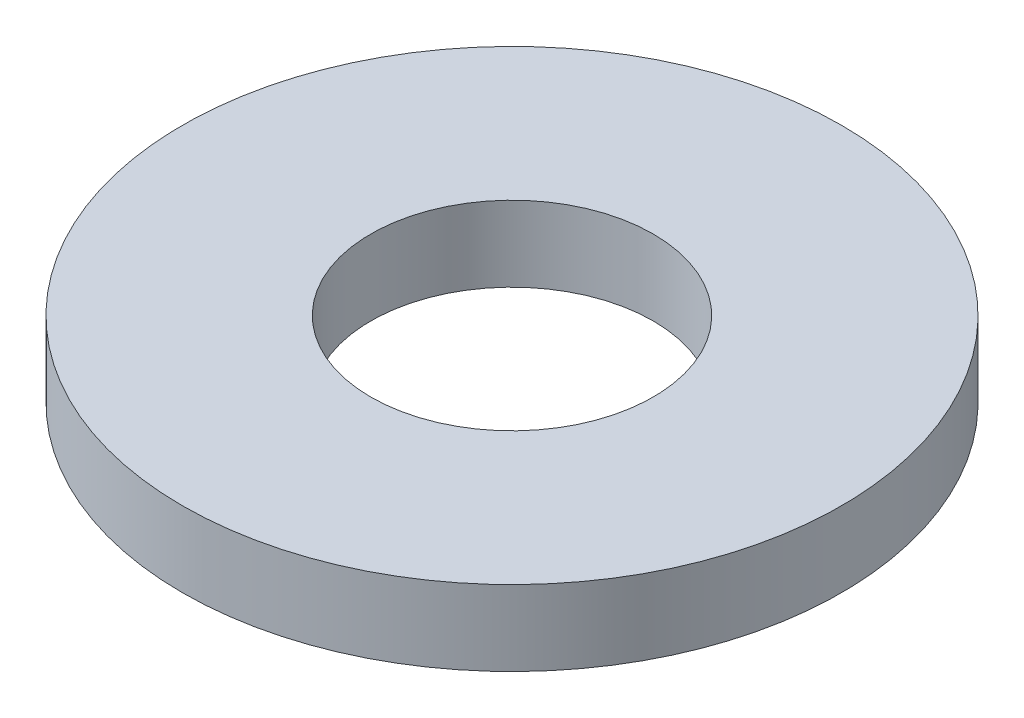
ISO-10303-21;
HEADER;
FILE_DESCRIPTION(('STEP AP214'),'2;1');
FILE_NAME('part.step','',(''),(''),'','','');
FILE_SCHEMA(('AUTOMOTIVE_DESIGN { 1 0 10303 214 1 1 1 1 }'));
ENDSEC;
DATA;
#1=APPLICATION_CONTEXT('core data for automotive mechanical design processes');
#2=APPLICATION_PROTOCOL_DEFINITION('international standard','automotive_design',2000,#1);
#3=PRODUCT_CONTEXT('',#1,'mechanical');
#4=PRODUCT('Part','Part','',(#3));
#5=PRODUCT_RELATED_PRODUCT_CATEGORY('part','',(#4));
#6=PRODUCT_DEFINITION_FORMATION('','',#4);
#7=PRODUCT_DEFINITION_CONTEXT('part definition',#1,'design');
#8=PRODUCT_DEFINITION('design','',#6,#7);
#9=PRODUCT_DEFINITION_SHAPE('','',#8);
#10=(LENGTH_UNIT() NAMED_UNIT(*) SI_UNIT(.MILLI.,.METRE.));
#11=(NAMED_UNIT(*) PLANE_ANGLE_UNIT() SI_UNIT($,.RADIAN.));
#12=(NAMED_UNIT(*) SI_UNIT($,.STERADIAN.) SOLID_ANGLE_UNIT());
#13=UNCERTAINTY_MEASURE_WITH_UNIT(LENGTH_MEASURE(1.E-05),#10,'distance_accuracy_value','');
#14=(GEOMETRIC_REPRESENTATION_CONTEXT(3) GLOBAL_UNCERTAINTY_ASSIGNED_CONTEXT((#13)) GLOBAL_UNIT_ASSIGNED_CONTEXT((#10,
#11,#12)) REPRESENTATION_CONTEXT('',''));
#15=CARTESIAN_POINT('',(0.,0.,0.));
#16=DIRECTION('',(0.,0.,1.));
#17=DIRECTION('',(1.,0.,0.));
#18=AXIS2_PLACEMENT_3D('',#15,#16,#17);
#19=CARTESIAN_POINT('',(0.,0.8,0.));
#20=DIRECTION('',(0.,1.,0.));
#21=DIRECTION('',(0.,0.,1.));
#22=AXIS2_PLACEMENT_3D('',#19,#20,#21);
#23=PLANE('',#22);
#24=CARTESIAN_POINT('',(0.,0.8,0.));
#25=DIRECTION('',(0.,1.,0.));
#26=DIRECTION('',(0.,0.,1.));
#27=AXIS2_PLACEMENT_3D('',#24,#25,#26);
#28=CIRCLE('',#27,3.5);
#29=CARTESIAN_POINT('',(0.,0.8,3.5));
#30=VERTEX_POINT('',#29);
#31=EDGE_CURVE('E10',#30,#30,#28,.T.);
#32=ORIENTED_EDGE('',*,*,#31,.T.);
#33=EDGE_LOOP('',(#32));
#34=FACE_BOUND('',#33,.T.);
#35=CARTESIAN_POINT('',(0.,0.8,0.));
#36=DIRECTION('',(0.,1.,0.));
#37=DIRECTION('',(0.,0.,1.));
#38=AXIS2_PLACEMENT_3D('',#35,#36,#37);
#39=CIRCLE('',#38,1.5);
#40=CARTESIAN_POINT('',(0.,0.8,1.5));
#41=VERTEX_POINT('',#40);
#42=EDGE_CURVE('E50',#41,#41,#39,.T.);
#43=ORIENTED_EDGE('',*,*,#42,.F.);
#44=EDGE_LOOP('',(#43));
#45=FACE_BOUND('',#44,.T.);
#46=ADVANCED_FACE('F36',(#34,#45),#23,.T.);
#47=CARTESIAN_POINT('',(0.,0.,0.));
#48=DIRECTION('',(0.,1.,0.));
#49=DIRECTION('',(0.,0.,1.));
#50=AXIS2_PLACEMENT_3D('',#47,#48,#49);
#51=PLANE('',#50);
#52=CARTESIAN_POINT('',(0.,0.,0.));
#53=DIRECTION('',(0.,1.,0.));
#54=DIRECTION('',(0.,0.,1.));
#55=AXIS2_PLACEMENT_3D('',#52,#53,#54);
#56=CIRCLE('',#55,3.5);
#57=CARTESIAN_POINT('',(0.,0.,3.5));
#58=VERTEX_POINT('',#57);
#59=EDGE_CURVE('E40',#58,#58,#56,.T.);
#60=ORIENTED_EDGE('',*,*,#59,.F.);
#61=EDGE_LOOP('',(#60));
#62=FACE_BOUND('',#61,.T.);
#63=CARTESIAN_POINT('',(0.,0.,0.));
#64=DIRECTION('',(0.,1.,0.));
#65=DIRECTION('',(0.,0.,1.));
#66=AXIS2_PLACEMENT_3D('',#63,#64,#65);
#67=CIRCLE('',#66,1.5);
#68=CARTESIAN_POINT('',(0.,0.,1.5));
#69=VERTEX_POINT('',#68);
#70=EDGE_CURVE('E52',#69,#69,#67,.T.);
#71=ORIENTED_EDGE('',*,*,#70,.T.);
#72=EDGE_LOOP('',(#71));
#73=FACE_BOUND('',#72,.T.);
#74=ADVANCED_FACE('F63',(#62,#73),#51,.F.);
#75=CARTESIAN_POINT('',(0.,0.8,0.));
#76=DIRECTION('',(0.,-1.,0.));
#77=DIRECTION('',(0.,0.,-1.));
#78=AXIS2_PLACEMENT_3D('',#75,#76,#77);
#79=CYLINDRICAL_SURFACE('',#78,3.5);
#80=ORIENTED_EDGE('',*,*,#31,.F.);
#81=EDGE_LOOP('',(#80));
#82=FACE_BOUND('',#81,.T.);
#83=ORIENTED_EDGE('',*,*,#59,.T.);
#84=EDGE_LOOP('',(#83));
#85=FACE_BOUND('',#84,.T.);
#86=ADVANCED_FACE('F38',(#82,#85),#79,.T.);
#87=CARTESIAN_POINT('',(0.,0.8,0.));
#88=DIRECTION('',(0.,-1.,0.));
#89=DIRECTION('',(0.,0.,-1.));
#90=AXIS2_PLACEMENT_3D('',#87,#88,#89);
#91=CYLINDRICAL_SURFACE('',#90,1.5);
#92=ORIENTED_EDGE('',*,*,#42,.T.);
#93=EDGE_LOOP('',(#92));
#94=FACE_BOUND('',#93,.T.);
#95=ORIENTED_EDGE('',*,*,#70,.F.);
#96=EDGE_LOOP('',(#95));
#97=FACE_BOUND('',#96,.T.);
#98=ADVANCED_FACE('F59',(#94,#97),#91,.F.);
#99=CLOSED_SHELL('',(#46,#74,#86,#98));
#100=MANIFOLD_SOLID_BREP('B2',#99);
#101=ADVANCED_BREP_SHAPE_REPRESENTATION('',(#18,#100),#14);
#102=SHAPE_DEFINITION_REPRESENTATION(#9,#101);
ENDSEC;
END-ISO-10303-21;
